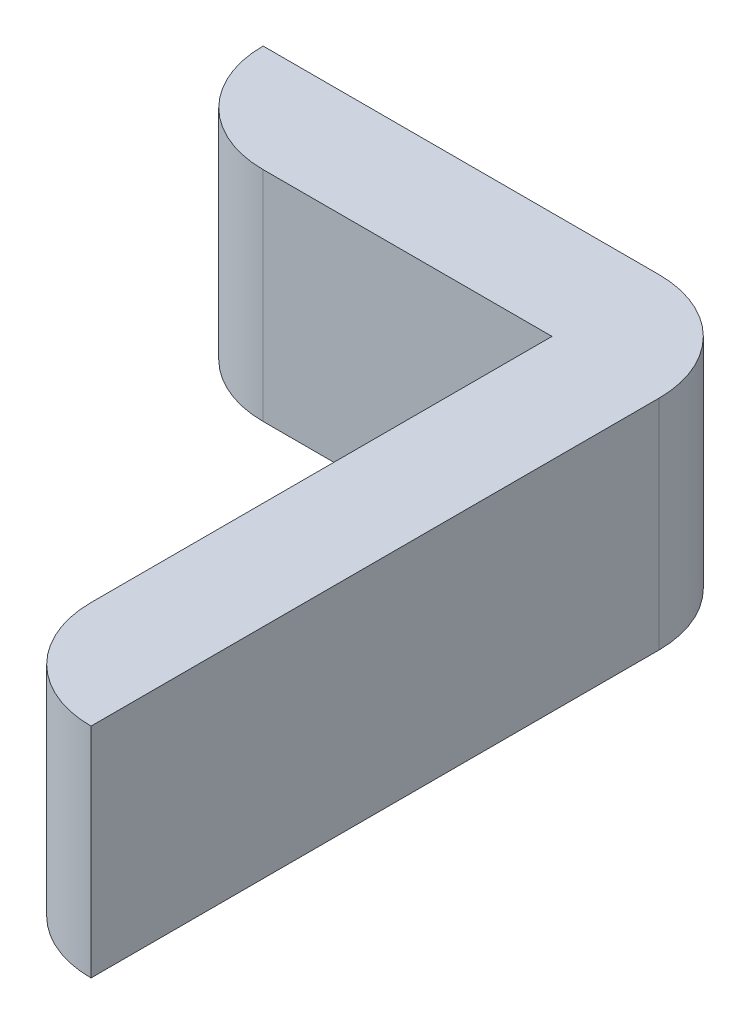
ISO-10303-21;
HEADER;
FILE_DESCRIPTION(('STEP AP214'),'2;1');
FILE_NAME('part.step','',(''),(''),'','','');
FILE_SCHEMA(('AUTOMOTIVE_DESIGN { 1 0 10303 214 1 1 1 1 }'));
ENDSEC;
DATA;
#1=APPLICATION_CONTEXT('core data for automotive mechanical design processes');
#2=APPLICATION_PROTOCOL_DEFINITION('international standard','automotive_design',2000,#1);
#3=PRODUCT_CONTEXT('',#1,'mechanical');
#4=PRODUCT('Part','Part','',(#3));
#5=PRODUCT_RELATED_PRODUCT_CATEGORY('part','',(#4));
#6=PRODUCT_DEFINITION_FORMATION('','',#4);
#7=PRODUCT_DEFINITION_CONTEXT('part definition',#1,'design');
#8=PRODUCT_DEFINITION('design','',#6,#7);
#9=PRODUCT_DEFINITION_SHAPE('','',#8);
#10=(LENGTH_UNIT() NAMED_UNIT(*) SI_UNIT(.MILLI.,.METRE.));
#11=(NAMED_UNIT(*) PLANE_ANGLE_UNIT() SI_UNIT($,.RADIAN.));
#12=(NAMED_UNIT(*) SI_UNIT($,.STERADIAN.) SOLID_ANGLE_UNIT());
#13=UNCERTAINTY_MEASURE_WITH_UNIT(LENGTH_MEASURE(1.E-05),#10,'distance_accuracy_value','');
#14=(GEOMETRIC_REPRESENTATION_CONTEXT(3) GLOBAL_UNCERTAINTY_ASSIGNED_CONTEXT((#13)) GLOBAL_UNIT_ASSIGNED_CONTEXT((#10,
#11,#12)) REPRESENTATION_CONTEXT('',''));
#15=CARTESIAN_POINT('',(0.,0.,0.));
#16=DIRECTION('',(0.,0.,1.));
#17=DIRECTION('',(1.,0.,0.));
#18=AXIS2_PLACEMENT_3D('',#15,#16,#17);
#19=CARTESIAN_POINT('',(-0.125,2.7948,0.));
#20=DIRECTION('',(0.,-1.,0.));
#21=DIRECTION('',(0.,0.,-1.));
#22=AXIS2_PLACEMENT_3D('',#19,#20,#21);
#23=PLANE('',#22);
#24=DIRECTION('',(-1.,0.,0.));
#25=VECTOR('',#24,1.);
#26=CARTESIAN_POINT('',(0.125,2.7948,0.25));
#27=LINE('',#26,#25);
#28=CARTESIAN_POINT('',(0.125,2.7948,0.25));
#29=VERTEX_POINT('',#28);
#30=CARTESIAN_POINT('',(0.8,2.7948,0.25));
#31=VERTEX_POINT('',#30);
#32=EDGE_CURVE('E102',#29,#31,#27,.F.);
#33=ORIENTED_EDGE('',*,*,#32,.T.);
#34=DIRECTION('',(0.,0.,-1.));
#35=VECTOR('',#34,1.);
#36=CARTESIAN_POINT('',(0.8,2.7948,0.25));
#37=LINE('',#36,#35);
#38=CARTESIAN_POINT('',(0.8,2.7948,1.327));
#39=VERTEX_POINT('',#38);
#40=EDGE_CURVE('E108',#31,#39,#37,.F.);
#41=ORIENTED_EDGE('',*,*,#40,.T.);
#42=CARTESIAN_POINT('',(1.05,2.7948,1.327));
#43=DIRECTION('',(0.,-1.,0.));
#44=DIRECTION('',(0.,0.,-1.));
#45=AXIS2_PLACEMENT_3D('',#42,#43,#44);
#46=CIRCLE('',#45,0.25);
#47=CARTESIAN_POINT('',(1.05,2.7948,1.577));
#48=VERTEX_POINT('',#47);
#49=EDGE_CURVE('E80',#48,#39,#46,.T.);
#50=ORIENTED_EDGE('',*,*,#49,.F.);
#51=DIRECTION('',(0.,0.,1.));
#52=VECTOR('',#51,1.);
#53=CARTESIAN_POINT('',(1.05,2.7948,1.577));
#54=LINE('',#53,#52);
#55=CARTESIAN_POINT('',(1.05,2.7948,0.25));
#56=VERTEX_POINT('',#55);
#57=EDGE_CURVE('E75',#48,#56,#54,.F.);
#58=ORIENTED_EDGE('',*,*,#57,.T.);
#59=CARTESIAN_POINT('',(0.8,2.7948,0.25));
#60=DIRECTION('',(0.,-1.,0.));
#61=DIRECTION('',(0.,0.,-1.));
#62=AXIS2_PLACEMENT_3D('',#59,#60,#61);
#63=CIRCLE('',#62,0.25);
#64=CARTESIAN_POINT('',(0.8,2.7948,0.));
#65=VERTEX_POINT('',#64);
#66=EDGE_CURVE('E19',#65,#56,#63,.T.);
#67=ORIENTED_EDGE('',*,*,#66,.F.);
#68=DIRECTION('',(1.,0.,0.));
#69=VECTOR('',#68,1.);
#70=CARTESIAN_POINT('',(0.8,2.7948,0.));
#71=LINE('',#70,#69);
#72=CARTESIAN_POINT('',(-0.125,2.7948,0.));
#73=VERTEX_POINT('',#72);
#74=EDGE_CURVE('E70',#65,#73,#71,.F.);
#75=ORIENTED_EDGE('',*,*,#74,.T.);
#76=CARTESIAN_POINT('',(0.125,2.7948,0.));
#77=DIRECTION('',(0.,-1.,0.));
#78=DIRECTION('',(0.,0.,-1.));
#79=AXIS2_PLACEMENT_3D('',#76,#77,#78);
#80=CIRCLE('',#79,0.25);
#81=EDGE_CURVE('E121',#29,#73,#80,.T.);
#82=ORIENTED_EDGE('',*,*,#81,.F.);
#83=EDGE_LOOP('',(#33,#41,#50,#58,#67,#75,#82));
#84=FACE_BOUND('',#83,.T.);
#85=ADVANCED_FACE('F16',(#84),#23,.F.);
#86=CARTESIAN_POINT('',(0.8,2.2852,0.));
#87=DIRECTION('',(0.,0.,1.));
#88=DIRECTION('',(1.,0.,0.));
#89=AXIS2_PLACEMENT_3D('',#86,#87,#88);
#90=PLANE('',#89);
#91=DIRECTION('',(0.,-1.,0.));
#92=VECTOR('',#91,1.);
#93=CARTESIAN_POINT('',(-0.125,2.2852,0.));
#94=LINE('',#93,#92);
#95=CARTESIAN_POINT('',(-0.125,2.2852,0.));
#96=VERTEX_POINT('',#95);
#97=EDGE_CURVE('E123',#73,#96,#94,.T.);
#98=ORIENTED_EDGE('',*,*,#97,.F.);
#99=ORIENTED_EDGE('',*,*,#74,.F.);
#100=DIRECTION('',(0.,-1.,0.));
#101=VECTOR('',#100,1.);
#102=CARTESIAN_POINT('',(0.8,2.2852,0.));
#103=LINE('',#102,#101);
#104=CARTESIAN_POINT('',(0.8,2.2852,0.));
#105=VERTEX_POINT('',#104);
#106=EDGE_CURVE('E92',#105,#65,#103,.F.);
#107=ORIENTED_EDGE('',*,*,#106,.F.);
#108=DIRECTION('',(1.,0.,0.));
#109=VECTOR('',#108,1.);
#110=CARTESIAN_POINT('',(-0.125,2.2852,0.));
#111=LINE('',#110,#109);
#112=EDGE_CURVE('E120',#96,#105,#111,.T.);
#113=ORIENTED_EDGE('',*,*,#112,.F.);
#114=EDGE_LOOP('',(#98,#99,#107,#113));
#115=FACE_BOUND('',#114,.T.);
#116=ADVANCED_FACE('F158',(#115),#90,.F.);
#117=CARTESIAN_POINT('',(0.8,2.2852,0.25));
#118=DIRECTION('',(0.,-1.,0.));
#119=DIRECTION('',(0.,0.,-1.));
#120=AXIS2_PLACEMENT_3D('',#117,#118,#119);
#121=CYLINDRICAL_SURFACE('',#120,0.25);
#122=ORIENTED_EDGE('',*,*,#66,.T.);
#123=DIRECTION('',(0.,1.,0.));
#124=VECTOR('',#123,1.);
#125=CARTESIAN_POINT('',(1.05,2.2852,0.25));
#126=LINE('',#125,#124);
#127=CARTESIAN_POINT('',(1.05,2.2852,0.25));
#128=VERTEX_POINT('',#127);
#129=EDGE_CURVE('E86',#56,#128,#126,.F.);
#130=ORIENTED_EDGE('',*,*,#129,.T.);
#131=CARTESIAN_POINT('',(0.8,2.2852,0.25));
#132=DIRECTION('',(0.,-1.,0.));
#133=DIRECTION('',(0.,0.,-1.));
#134=AXIS2_PLACEMENT_3D('',#131,#132,#133);
#135=CIRCLE('',#134,0.25);
#136=EDGE_CURVE('E118',#105,#128,#135,.T.);
#137=ORIENTED_EDGE('',*,*,#136,.F.);
#138=ORIENTED_EDGE('',*,*,#106,.T.);
#139=EDGE_LOOP('',(#122,#130,#137,#138));
#140=FACE_BOUND('',#139,.T.);
#141=ADVANCED_FACE('F89',(#140),#121,.T.);
#142=CARTESIAN_POINT('',(1.05,2.2852,1.577));
#143=DIRECTION('',(-1.,0.,0.));
#144=DIRECTION('',(0.,0.,1.));
#145=AXIS2_PLACEMENT_3D('',#142,#143,#144);
#146=PLANE('',#145);
#147=DIRECTION('',(0.,-1.,0.));
#148=VECTOR('',#147,1.);
#149=CARTESIAN_POINT('',(1.05,2.2852,1.577));
#150=LINE('',#149,#148);
#151=CARTESIAN_POINT('',(1.05,2.2852,1.577));
#152=VERTEX_POINT('',#151);
#153=EDGE_CURVE('E85',#152,#48,#150,.F.);
#154=ORIENTED_EDGE('',*,*,#153,.F.);
#155=DIRECTION('',(0.,0.,-1.));
#156=VECTOR('',#155,1.);
#157=CARTESIAN_POINT('',(1.05,2.2852,0.));
#158=LINE('',#157,#156);
#159=EDGE_CURVE('E94',#128,#152,#158,.F.);
#160=ORIENTED_EDGE('',*,*,#159,.F.);
#161=ORIENTED_EDGE('',*,*,#129,.F.);
#162=ORIENTED_EDGE('',*,*,#57,.F.);
#163=EDGE_LOOP('',(#154,#160,#161,#162));
#164=FACE_BOUND('',#163,.T.);
#165=ADVANCED_FACE('F93',(#164),#146,.F.);
#166=CARTESIAN_POINT('',(1.05,2.2852,1.327));
#167=DIRECTION('',(0.,-1.,0.));
#168=DIRECTION('',(0.,0.,-1.));
#169=AXIS2_PLACEMENT_3D('',#166,#167,#168);
#170=CYLINDRICAL_SURFACE('',#169,0.25);
#171=ORIENTED_EDGE('',*,*,#49,.T.);
#172=DIRECTION('',(0.,1.,0.));
#173=VECTOR('',#172,1.);
#174=CARTESIAN_POINT('',(0.8,2.2852,1.327));
#175=LINE('',#174,#173);
#176=CARTESIAN_POINT('',(0.8,2.2852,1.327));
#177=VERTEX_POINT('',#176);
#178=EDGE_CURVE('E105',#39,#177,#175,.F.);
#179=ORIENTED_EDGE('',*,*,#178,.T.);
#180=CARTESIAN_POINT('',(1.05,2.2852,1.327));
#181=DIRECTION('',(0.,-1.,0.));
#182=DIRECTION('',(0.,0.,-1.));
#183=AXIS2_PLACEMENT_3D('',#180,#181,#182);
#184=CIRCLE('',#183,0.25);
#185=EDGE_CURVE('E114',#152,#177,#184,.T.);
#186=ORIENTED_EDGE('',*,*,#185,.F.);
#187=ORIENTED_EDGE('',*,*,#153,.T.);
#188=EDGE_LOOP('',(#171,#179,#186,#187));
#189=FACE_BOUND('',#188,.T.);
#190=ADVANCED_FACE('F127',(#189),#170,.T.);
#191=CARTESIAN_POINT('',(0.8,2.2852,0.25));
#192=DIRECTION('',(1.,0.,0.));
#193=DIRECTION('',(0.,0.,-1.));
#194=AXIS2_PLACEMENT_3D('',#191,#192,#193);
#195=PLANE('',#194);
#196=ORIENTED_EDGE('',*,*,#178,.F.);
#197=ORIENTED_EDGE('',*,*,#40,.F.);
#198=DIRECTION('',(0.,1.,0.));
#199=VECTOR('',#198,1.);
#200=CARTESIAN_POINT('',(0.8,2.2852,0.25));
#201=LINE('',#200,#199);
#202=CARTESIAN_POINT('',(0.8,2.2852,0.25));
#203=VERTEX_POINT('',#202);
#204=EDGE_CURVE('E104',#31,#203,#201,.F.);
#205=ORIENTED_EDGE('',*,*,#204,.T.);
#206=DIRECTION('',(0.,0.,-1.));
#207=VECTOR('',#206,1.);
#208=CARTESIAN_POINT('',(0.8,2.2852,0.));
#209=LINE('',#208,#207);
#210=EDGE_CURVE('E117',#177,#203,#209,.T.);
#211=ORIENTED_EDGE('',*,*,#210,.F.);
#212=EDGE_LOOP('',(#196,#197,#205,#211));
#213=FACE_BOUND('',#212,.T.);
#214=ADVANCED_FACE('F150',(#213),#195,.F.);
#215=CARTESIAN_POINT('',(0.125,2.2852,0.25));
#216=DIRECTION('',(0.,0.,-1.));
#217=DIRECTION('',(-1.,0.,0.));
#218=AXIS2_PLACEMENT_3D('',#215,#216,#217);
#219=PLANE('',#218);
#220=ORIENTED_EDGE('',*,*,#204,.F.);
#221=ORIENTED_EDGE('',*,*,#32,.F.);
#222=DIRECTION('',(0.,-1.,0.));
#223=VECTOR('',#222,1.);
#224=CARTESIAN_POINT('',(0.125,2.2852,0.25));
#225=LINE('',#224,#223);
#226=CARTESIAN_POINT('',(0.125,2.2852,0.25));
#227=VERTEX_POINT('',#226);
#228=EDGE_CURVE('E34',#227,#29,#225,.F.);
#229=ORIENTED_EDGE('',*,*,#228,.F.);
#230=DIRECTION('',(1.,0.,0.));
#231=VECTOR('',#230,1.);
#232=CARTESIAN_POINT('',(-0.125,2.2852,0.25));
#233=LINE('',#232,#231);
#234=EDGE_CURVE('E25',#203,#227,#233,.F.);
#235=ORIENTED_EDGE('',*,*,#234,.F.);
#236=EDGE_LOOP('',(#220,#221,#229,#235));
#237=FACE_BOUND('',#236,.T.);
#238=ADVANCED_FACE('F151',(#237),#219,.F.);
#239=CARTESIAN_POINT('',(0.125,2.2852,0.));
#240=DIRECTION('',(0.,-1.,0.));
#241=DIRECTION('',(0.,0.,-1.));
#242=AXIS2_PLACEMENT_3D('',#239,#240,#241);
#243=CYLINDRICAL_SURFACE('',#242,0.25);
#244=ORIENTED_EDGE('',*,*,#81,.T.);
#245=ORIENTED_EDGE('',*,*,#97,.T.);
#246=CARTESIAN_POINT('',(0.125,2.2852,0.));
#247=DIRECTION('',(0.,-1.,0.));
#248=DIRECTION('',(0.,0.,-1.));
#249=AXIS2_PLACEMENT_3D('',#246,#247,#248);
#250=CIRCLE('',#249,0.25);
#251=EDGE_CURVE('E11',#227,#96,#250,.T.);
#252=ORIENTED_EDGE('',*,*,#251,.F.);
#253=ORIENTED_EDGE('',*,*,#228,.T.);
#254=EDGE_LOOP('',(#244,#245,#252,#253));
#255=FACE_BOUND('',#254,.T.);
#256=ADVANCED_FACE('F156',(#255),#243,.T.);
#257=CARTESIAN_POINT('',(-0.125,2.2852,0.));
#258=DIRECTION('',(0.,-1.,0.));
#259=DIRECTION('',(0.,0.,-1.));
#260=AXIS2_PLACEMENT_3D('',#257,#258,#259);
#261=PLANE('',#260);
#262=ORIENTED_EDGE('',*,*,#234,.T.);
#263=ORIENTED_EDGE('',*,*,#251,.T.);
#264=ORIENTED_EDGE('',*,*,#112,.T.);
#265=ORIENTED_EDGE('',*,*,#136,.T.);
#266=ORIENTED_EDGE('',*,*,#159,.T.);
#267=ORIENTED_EDGE('',*,*,#185,.T.);
#268=ORIENTED_EDGE('',*,*,#210,.T.);
#269=EDGE_LOOP('',(#262,#263,#264,#265,#266,#267,#268));
#270=FACE_BOUND('',#269,.T.);
#271=ADVANCED_FACE('F132',(#270),#261,.T.);
#272=CLOSED_SHELL('',(#85,#116,#141,#165,#190,#214,#238,#256,#271));
#273=MANIFOLD_SOLID_BREP('B1',#272);
#274=ADVANCED_BREP_SHAPE_REPRESENTATION('',(#18,#273),#14);
#275=SHAPE_DEFINITION_REPRESENTATION(#9,#274);
ENDSEC;
END-ISO-10303-21;
